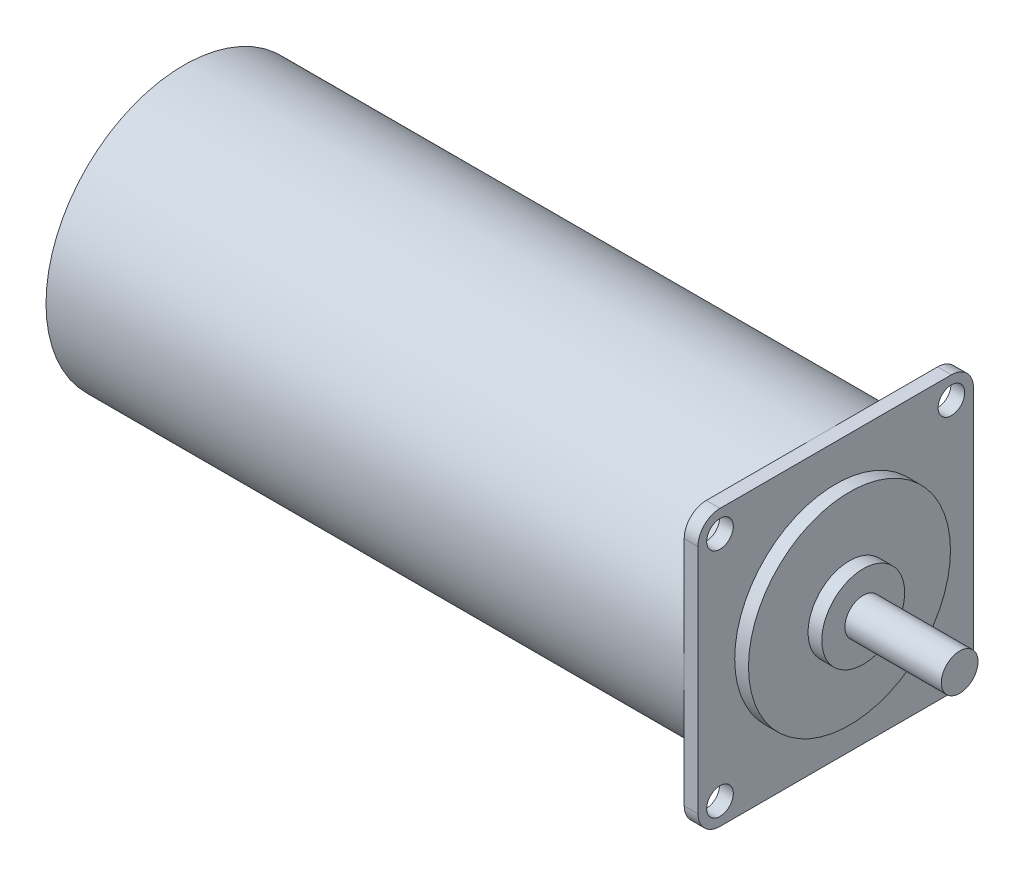
ISO-10303-21;
HEADER;
FILE_DESCRIPTION(('STEP AP214'),'2;1');
FILE_NAME('part.step','',(''),(''),'','','');
FILE_SCHEMA(('AUTOMOTIVE_DESIGN { 1 0 10303 214 1 1 1 1 }'));
ENDSEC;
DATA;
#1=APPLICATION_CONTEXT('core data for automotive mechanical design processes');
#2=APPLICATION_PROTOCOL_DEFINITION('international standard','automotive_design',2000,#1);
#3=PRODUCT_CONTEXT('',#1,'mechanical');
#4=PRODUCT('Part','Part','',(#3));
#5=PRODUCT_RELATED_PRODUCT_CATEGORY('part','',(#4));
#6=PRODUCT_DEFINITION_FORMATION('','',#4);
#7=PRODUCT_DEFINITION_CONTEXT('part definition',#1,'design');
#8=PRODUCT_DEFINITION('design','',#6,#7);
#9=PRODUCT_DEFINITION_SHAPE('','',#8);
#10=(LENGTH_UNIT() NAMED_UNIT(*) SI_UNIT(.MILLI.,.METRE.));
#11=(NAMED_UNIT(*) PLANE_ANGLE_UNIT() SI_UNIT($,.RADIAN.));
#12=(NAMED_UNIT(*) SI_UNIT($,.STERADIAN.) SOLID_ANGLE_UNIT());
#13=UNCERTAINTY_MEASURE_WITH_UNIT(LENGTH_MEASURE(1.E-05),#10,'distance_accuracy_value','');
#14=(GEOMETRIC_REPRESENTATION_CONTEXT(3) GLOBAL_UNCERTAINTY_ASSIGNED_CONTEXT((#13)) GLOBAL_UNIT_ASSIGNED_CONTEXT((#10,
#11,#12)) REPRESENTATION_CONTEXT('',''));
#15=CARTESIAN_POINT('',(0.,0.,0.));
#16=DIRECTION('',(0.,0.,1.));
#17=DIRECTION('',(1.,0.,0.));
#18=AXIS2_PLACEMENT_3D('',#15,#16,#17);
#19=CARTESIAN_POINT('',(71.,15.,0.));
#20=DIRECTION('',(-1.,0.,0.));
#21=DIRECTION('',(0.,0.,1.));
#22=AXIS2_PLACEMENT_3D('',#19,#20,#21);
#23=PLANE('',#22);
#24=DIRECTION('',(0.,0.,-1.));
#25=VECTOR('',#24,1.);
#26=CARTESIAN_POINT('',(71.,-15.,-15.));
#27=LINE('',#26,#25);
#28=CARTESIAN_POINT('',(71.,-15.,12.6));
#29=VERTEX_POINT('',#28);
#30=CARTESIAN_POINT('',(71.,-15.,-12.6));
#31=VERTEX_POINT('',#30);
#32=EDGE_CURVE('E227',#29,#31,#27,.T.);
#33=ORIENTED_EDGE('',*,*,#32,.T.);
#34=CARTESIAN_POINT('',(71.,-12.6,-12.6));
#35=DIRECTION('',(-1.,0.,0.));
#36=DIRECTION('',(0.,0.,1.));
#37=AXIS2_PLACEMENT_3D('',#34,#35,#36);
#38=CIRCLE('',#37,2.4);
#39=CARTESIAN_POINT('',(71.,-12.6,-15.));
#40=VERTEX_POINT('',#39);
#41=EDGE_CURVE('E182',#31,#40,#38,.F.);
#42=ORIENTED_EDGE('',*,*,#41,.T.);
#43=DIRECTION('',(0.,1.,0.));
#44=VECTOR('',#43,1.);
#45=CARTESIAN_POINT('',(71.,-15.,-15.));
#46=LINE('',#45,#44);
#47=CARTESIAN_POINT('',(71.,12.6,-15.));
#48=VERTEX_POINT('',#47);
#49=EDGE_CURVE('E222',#40,#48,#46,.T.);
#50=ORIENTED_EDGE('',*,*,#49,.T.);
#51=CARTESIAN_POINT('',(71.,12.6,-12.6));
#52=DIRECTION('',(-1.,0.,0.));
#53=DIRECTION('',(0.,0.,1.));
#54=AXIS2_PLACEMENT_3D('',#51,#52,#53);
#55=CIRCLE('',#54,2.4);
#56=CARTESIAN_POINT('',(71.,15.,-12.6));
#57=VERTEX_POINT('',#56);
#58=EDGE_CURVE('E173',#48,#57,#55,.F.);
#59=ORIENTED_EDGE('',*,*,#58,.T.);
#60=DIRECTION('',(0.,0.,1.));
#61=VECTOR('',#60,1.);
#62=CARTESIAN_POINT('',(71.,15.,-15.));
#63=LINE('',#62,#61);
#64=CARTESIAN_POINT('',(71.,15.,12.6));
#65=VERTEX_POINT('',#64);
#66=EDGE_CURVE('E212',#57,#65,#63,.T.);
#67=ORIENTED_EDGE('',*,*,#66,.T.);
#68=CARTESIAN_POINT('',(71.,12.6,12.6));
#69=DIRECTION('',(-1.,0.,0.));
#70=DIRECTION('',(0.,0.,1.));
#71=AXIS2_PLACEMENT_3D('',#68,#69,#70);
#72=CIRCLE('',#71,2.4);
#73=CARTESIAN_POINT('',(71.,12.6,15.));
#74=VERTEX_POINT('',#73);
#75=EDGE_CURVE('E176',#65,#74,#72,.F.);
#76=ORIENTED_EDGE('',*,*,#75,.T.);
#77=DIRECTION('',(0.,-1.,0.));
#78=VECTOR('',#77,1.);
#79=CARTESIAN_POINT('',(71.,-15.,15.));
#80=LINE('',#79,#78);
#81=CARTESIAN_POINT('',(71.,-12.6,15.));
#82=VERTEX_POINT('',#81);
#83=EDGE_CURVE('E221',#74,#82,#80,.T.);
#84=ORIENTED_EDGE('',*,*,#83,.T.);
#85=CARTESIAN_POINT('',(71.,-12.6,12.6));
#86=DIRECTION('',(-1.,0.,0.));
#87=DIRECTION('',(0.,0.,1.));
#88=AXIS2_PLACEMENT_3D('',#85,#86,#87);
#89=CIRCLE('',#88,2.4);
#90=EDGE_CURVE('E179',#82,#29,#89,.F.);
#91=ORIENTED_EDGE('',*,*,#90,.T.);
#92=EDGE_LOOP('',(#33,#42,#50,#59,#67,#76,#84,#91));
#93=FACE_BOUND('',#92,.T.);
#94=CARTESIAN_POINT('',(71.,0.,0.));
#95=DIRECTION('',(-1.,0.,0.));
#96=DIRECTION('',(0.,0.,1.));
#97=AXIS2_PLACEMENT_3D('',#94,#95,#96);
#98=CIRCLE('',#97,11.);
#99=CARTESIAN_POINT('',(71.,0.,11.));
#100=VERTEX_POINT('',#99);
#101=EDGE_CURVE('E251',#100,#100,#98,.T.);
#102=ORIENTED_EDGE('',*,*,#101,.T.);
#103=EDGE_LOOP('',(#102));
#104=FACE_BOUND('',#103,.T.);
#105=CARTESIAN_POINT('',(71.,-12.6,12.6));
#106=DIRECTION('',(1.,0.,0.));
#107=DIRECTION('',(0.,0.,1.));
#108=AXIS2_PLACEMENT_3D('',#105,#106,#107);
#109=CIRCLE('',#108,1.45);
#110=CARTESIAN_POINT('',(71.,-12.6,14.05));
#111=VERTEX_POINT('',#110);
#112=EDGE_CURVE('E340',#111,#111,#109,.T.);
#113=ORIENTED_EDGE('',*,*,#112,.F.);
#114=EDGE_LOOP('',(#113));
#115=FACE_BOUND('',#114,.T.);
#116=CARTESIAN_POINT('',(71.,-12.6,-12.6));
#117=DIRECTION('',(1.,0.,0.));
#118=DIRECTION('',(0.,0.,-1.));
#119=AXIS2_PLACEMENT_3D('',#116,#117,#118);
#120=CIRCLE('',#119,1.45);
#121=CARTESIAN_POINT('',(71.,-12.6,-14.05));
#122=VERTEX_POINT('',#121);
#123=EDGE_CURVE('E345',#122,#122,#120,.T.);
#124=ORIENTED_EDGE('',*,*,#123,.F.);
#125=EDGE_LOOP('',(#124));
#126=FACE_BOUND('',#125,.T.);
#127=CARTESIAN_POINT('',(71.,12.6,-12.6));
#128=DIRECTION('',(1.,0.,0.));
#129=DIRECTION('',(0.,0.,1.));
#130=AXIS2_PLACEMENT_3D('',#127,#128,#129);
#131=CIRCLE('',#130,1.45);
#132=CARTESIAN_POINT('',(71.,12.6,-11.15));
#133=VERTEX_POINT('',#132);
#134=EDGE_CURVE('E352',#133,#133,#131,.T.);
#135=ORIENTED_EDGE('',*,*,#134,.F.);
#136=EDGE_LOOP('',(#135));
#137=FACE_BOUND('',#136,.T.);
#138=CARTESIAN_POINT('',(71.,12.6,12.6));
#139=DIRECTION('',(1.,0.,0.));
#140=DIRECTION('',(0.,0.,-1.));
#141=AXIS2_PLACEMENT_3D('',#138,#139,#140);
#142=CIRCLE('',#141,1.45);
#143=CARTESIAN_POINT('',(71.,12.6,11.15));
#144=VERTEX_POINT('',#143);
#145=EDGE_CURVE('E360',#144,#144,#142,.T.);
#146=ORIENTED_EDGE('',*,*,#145,.F.);
#147=EDGE_LOOP('',(#146));
#148=FACE_BOUND('',#147,.T.);
#149=ADVANCED_FACE('F39',(#93,#104,#115,#126,#137,#148),#23,.F.);
#150=CARTESIAN_POINT('',(0.,0.,0.));
#151=DIRECTION('',(-1.,0.,0.));
#152=DIRECTION('',(0.,0.,1.));
#153=AXIS2_PLACEMENT_3D('',#150,#151,#152);
#154=CYLINDRICAL_SURFACE('',#153,11.);
#155=ORIENTED_EDGE('',*,*,#101,.F.);
#156=EDGE_LOOP('',(#155));
#157=FACE_BOUND('',#156,.T.);
#158=CARTESIAN_POINT('',(72.5,0.,0.));
#159=DIRECTION('',(-1.,0.,0.));
#160=DIRECTION('',(0.,0.,1.));
#161=AXIS2_PLACEMENT_3D('',#158,#159,#160);
#162=CIRCLE('',#161,11.);
#163=CARTESIAN_POINT('',(72.5,0.,11.));
#164=VERTEX_POINT('',#163);
#165=EDGE_CURVE('E248',#164,#164,#162,.T.);
#166=ORIENTED_EDGE('',*,*,#165,.T.);
#167=EDGE_LOOP('',(#166));
#168=FACE_BOUND('',#167,.T.);
#169=ADVANCED_FACE('F274',(#157,#168),#154,.T.);
#170=CARTESIAN_POINT('',(72.5,11.,0.));
#171=DIRECTION('',(-1.,0.,0.));
#172=DIRECTION('',(0.,0.,1.));
#173=AXIS2_PLACEMENT_3D('',#170,#171,#172);
#174=PLANE('',#173);
#175=ORIENTED_EDGE('',*,*,#165,.F.);
#176=EDGE_LOOP('',(#175));
#177=FACE_BOUND('',#176,.T.);
#178=CARTESIAN_POINT('',(72.5,0.,0.));
#179=DIRECTION('',(-1.,0.,0.));
#180=DIRECTION('',(0.,0.,1.));
#181=AXIS2_PLACEMENT_3D('',#178,#179,#180);
#182=CIRCLE('',#181,4.51182210726465);
#183=CARTESIAN_POINT('',(72.5,0.,4.51182210726465));
#184=VERTEX_POINT('',#183);
#185=EDGE_CURVE('E244',#184,#184,#182,.T.);
#186=ORIENTED_EDGE('',*,*,#185,.T.);
#187=EDGE_LOOP('',(#186));
#188=FACE_BOUND('',#187,.T.);
#189=ADVANCED_FACE('F278',(#177,#188),#174,.F.);
#190=CARTESIAN_POINT('',(0.,0.,0.));
#191=DIRECTION('',(-1.,0.,0.));
#192=DIRECTION('',(0.,0.,1.));
#193=AXIS2_PLACEMENT_3D('',#190,#191,#192);
#194=CYLINDRICAL_SURFACE('',#193,4.51182210726465);
#195=ORIENTED_EDGE('',*,*,#185,.F.);
#196=EDGE_LOOP('',(#195));
#197=FACE_BOUND('',#196,.T.);
#198=CARTESIAN_POINT('',(74.,0.,0.));
#199=DIRECTION('',(-1.,0.,0.));
#200=DIRECTION('',(0.,0.,1.));
#201=AXIS2_PLACEMENT_3D('',#198,#199,#200);
#202=CIRCLE('',#201,4.51182210726465);
#203=CARTESIAN_POINT('',(74.,0.,4.51182210726465));
#204=VERTEX_POINT('',#203);
#205=EDGE_CURVE('E240',#204,#204,#202,.T.);
#206=ORIENTED_EDGE('',*,*,#205,.T.);
#207=EDGE_LOOP('',(#206));
#208=FACE_BOUND('',#207,.T.);
#209=ADVANCED_FACE('F284',(#197,#208),#194,.T.);
#210=CARTESIAN_POINT('',(74.,4.51182210726465,0.));
#211=DIRECTION('',(-1.,0.,0.));
#212=DIRECTION('',(0.,0.,1.));
#213=AXIS2_PLACEMENT_3D('',#210,#211,#212);
#214=PLANE('',#213);
#215=ORIENTED_EDGE('',*,*,#205,.F.);
#216=EDGE_LOOP('',(#215));
#217=FACE_BOUND('',#216,.T.);
#218=CARTESIAN_POINT('',(74.,0.,0.));
#219=DIRECTION('',(-1.,0.,0.));
#220=DIRECTION('',(0.,0.,1.));
#221=AXIS2_PLACEMENT_3D('',#218,#219,#220);
#222=CIRCLE('',#221,2.);
#223=CARTESIAN_POINT('',(74.,0.,2.));
#224=VERTEX_POINT('',#223);
#225=EDGE_CURVE('E235',#224,#224,#222,.T.);
#226=ORIENTED_EDGE('',*,*,#225,.T.);
#227=EDGE_LOOP('',(#226));
#228=FACE_BOUND('',#227,.T.);
#229=ADVANCED_FACE('F288',(#217,#228),#214,.F.);
#230=CARTESIAN_POINT('',(0.,0.,0.));
#231=DIRECTION('',(-1.,0.,0.));
#232=DIRECTION('',(0.,0.,1.));
#233=AXIS2_PLACEMENT_3D('',#230,#231,#232);
#234=CYLINDRICAL_SURFACE('',#233,2.);
#235=ORIENTED_EDGE('',*,*,#225,.F.);
#236=EDGE_LOOP('',(#235));
#237=FACE_BOUND('',#236,.T.);
#238=CARTESIAN_POINT('',(84.5,0.,0.));
#239=DIRECTION('',(-1.,0.,0.));
#240=DIRECTION('',(0.,0.,1.));
#241=AXIS2_PLACEMENT_3D('',#238,#239,#240);
#242=CIRCLE('',#241,2.);
#243=CARTESIAN_POINT('',(84.5,0.,2.));
#244=VERTEX_POINT('',#243);
#245=EDGE_CURVE('E231',#244,#244,#242,.T.);
#246=ORIENTED_EDGE('',*,*,#245,.T.);
#247=EDGE_LOOP('',(#246));
#248=FACE_BOUND('',#247,.T.);
#249=ADVANCED_FACE('F292',(#237,#248),#234,.T.);
#250=CARTESIAN_POINT('',(84.5,2.,0.));
#251=DIRECTION('',(-1.,0.,0.));
#252=DIRECTION('',(0.,0.,1.));
#253=AXIS2_PLACEMENT_3D('',#250,#251,#252);
#254=PLANE('',#253);
#255=ORIENTED_EDGE('',*,*,#245,.F.);
#256=EDGE_LOOP('',(#255));
#257=FACE_BOUND('',#256,.T.);
#258=ADVANCED_FACE('F296',(#257),#254,.F.);
#259=CARTESIAN_POINT('',(69.5,0.,0.));
#260=DIRECTION('',(-1.,0.,0.));
#261=DIRECTION('',(0.,0.,1.));
#262=AXIS2_PLACEMENT_3D('',#259,#260,#261);
#263=PLANE('',#262);
#264=DIRECTION('',(0.,-1.,0.));
#265=VECTOR('',#264,1.);
#266=CARTESIAN_POINT('',(69.5,-15.,15.));
#267=LINE('',#266,#265);
#268=CARTESIAN_POINT('',(69.5,12.6,15.));
#269=VERTEX_POINT('',#268);
#270=CARTESIAN_POINT('',(69.5,0.,15.));
#271=VERTEX_POINT('',#270);
#272=EDGE_CURVE('E236',#269,#271,#267,.T.);
#273=ORIENTED_EDGE('',*,*,#272,.F.);
#274=CARTESIAN_POINT('',(69.5,12.6,12.6));
#275=DIRECTION('',(-1.,0.,0.));
#276=DIRECTION('',(0.,0.,1.));
#277=AXIS2_PLACEMENT_3D('',#274,#275,#276);
#278=CIRCLE('',#277,2.4);
#279=CARTESIAN_POINT('',(69.5,15.,12.6));
#280=VERTEX_POINT('',#279);
#281=EDGE_CURVE('E48',#269,#280,#278,.T.);
#282=ORIENTED_EDGE('',*,*,#281,.T.);
#283=DIRECTION('',(0.,0.,1.));
#284=VECTOR('',#283,1.);
#285=CARTESIAN_POINT('',(69.5,15.,-15.));
#286=LINE('',#285,#284);
#287=CARTESIAN_POINT('',(69.5,15.,0.));
#288=VERTEX_POINT('',#287);
#289=EDGE_CURVE('E131',#288,#280,#286,.T.);
#290=ORIENTED_EDGE('',*,*,#289,.F.);
#291=CARTESIAN_POINT('',(69.5,0.,0.));
#292=DIRECTION('',(-1.,0.,0.));
#293=DIRECTION('',(0.,0.,1.));
#294=AXIS2_PLACEMENT_3D('',#291,#292,#293);
#295=CIRCLE('',#294,15.);
#296=EDGE_CURVE('E158',#271,#288,#295,.T.);
#297=ORIENTED_EDGE('',*,*,#296,.F.);
#298=EDGE_LOOP('',(#273,#282,#290,#297));
#299=FACE_BOUND('',#298,.T.);
#300=CARTESIAN_POINT('',(69.5,12.6,12.6));
#301=DIRECTION('',(1.,0.,0.));
#302=DIRECTION('',(0.,0.,-1.));
#303=AXIS2_PLACEMENT_3D('',#300,#301,#302);
#304=CIRCLE('',#303,1.45);
#305=CARTESIAN_POINT('',(69.5,12.6,11.15));
#306=VERTEX_POINT('',#305);
#307=EDGE_CURVE('E364',#306,#306,#304,.T.);
#308=ORIENTED_EDGE('',*,*,#307,.T.);
#309=EDGE_LOOP('',(#308));
#310=FACE_BOUND('',#309,.T.);
#311=ADVANCED_FACE('F300',(#299,#310),#263,.T.);
#312=CARTESIAN_POINT('',(69.5,15.,-12.6));
#313=VERTEX_POINT('',#312);
#314=EDGE_CURVE('E373',#313,#288,#286,.T.);
#315=ORIENTED_EDGE('',*,*,#314,.F.);
#316=CARTESIAN_POINT('',(69.5,12.6,-12.6));
#317=DIRECTION('',(-1.,0.,0.));
#318=DIRECTION('',(0.,0.,1.));
#319=AXIS2_PLACEMENT_3D('',#316,#317,#318);
#320=CIRCLE('',#319,2.4);
#321=CARTESIAN_POINT('',(69.5,12.6,-15.));
#322=VERTEX_POINT('',#321);
#323=EDGE_CURVE('E11',#313,#322,#320,.T.);
#324=ORIENTED_EDGE('',*,*,#323,.T.);
#325=DIRECTION('',(0.,1.,0.));
#326=VECTOR('',#325,1.);
#327=CARTESIAN_POINT('',(69.5,-15.,-15.));
#328=LINE('',#327,#326);
#329=CARTESIAN_POINT('',(69.5,0.,-15.));
#330=VERTEX_POINT('',#329);
#331=EDGE_CURVE('E124',#330,#322,#328,.T.);
#332=ORIENTED_EDGE('',*,*,#331,.F.);
#333=EDGE_CURVE('E144',#288,#330,#295,.T.);
#334=ORIENTED_EDGE('',*,*,#333,.F.);
#335=EDGE_LOOP('',(#315,#324,#332,#334));
#336=FACE_BOUND('',#335,.T.);
#337=CARTESIAN_POINT('',(69.5,12.6,-12.6));
#338=DIRECTION('',(1.,0.,0.));
#339=DIRECTION('',(0.,0.,1.));
#340=AXIS2_PLACEMENT_3D('',#337,#338,#339);
#341=CIRCLE('',#340,1.45);
#342=CARTESIAN_POINT('',(69.5,12.6,-11.15));
#343=VERTEX_POINT('',#342);
#344=EDGE_CURVE('E356',#343,#343,#341,.T.);
#345=ORIENTED_EDGE('',*,*,#344,.T.);
#346=EDGE_LOOP('',(#345));
#347=FACE_BOUND('',#346,.T.);
#348=ADVANCED_FACE('F149',(#336,#347),#263,.T.);
#349=CARTESIAN_POINT('',(69.5,-12.6,-15.));
#350=VERTEX_POINT('',#349);
#351=EDGE_CURVE('E118',#350,#330,#328,.T.);
#352=ORIENTED_EDGE('',*,*,#351,.F.);
#353=CARTESIAN_POINT('',(69.5,-12.6,-12.6));
#354=DIRECTION('',(-1.,0.,0.));
#355=DIRECTION('',(0.,0.,1.));
#356=AXIS2_PLACEMENT_3D('',#353,#354,#355);
#357=CIRCLE('',#356,2.4);
#358=CARTESIAN_POINT('',(69.5,-15.,-12.6));
#359=VERTEX_POINT('',#358);
#360=EDGE_CURVE('E190',#350,#359,#357,.T.);
#361=ORIENTED_EDGE('',*,*,#360,.T.);
#362=DIRECTION('',(0.,0.,-1.));
#363=VECTOR('',#362,1.);
#364=CARTESIAN_POINT('',(69.5,-15.,-15.));
#365=LINE('',#364,#363);
#366=CARTESIAN_POINT('',(69.5,-15.,0.));
#367=VERTEX_POINT('',#366);
#368=EDGE_CURVE('E139',#367,#359,#365,.T.);
#369=ORIENTED_EDGE('',*,*,#368,.F.);
#370=EDGE_CURVE('E135',#330,#367,#295,.T.);
#371=ORIENTED_EDGE('',*,*,#370,.F.);
#372=EDGE_LOOP('',(#352,#361,#369,#371));
#373=FACE_BOUND('',#372,.T.);
#374=CARTESIAN_POINT('',(69.5,-12.6,-12.6));
#375=DIRECTION('',(1.,0.,0.));
#376=DIRECTION('',(0.,0.,-1.));
#377=AXIS2_PLACEMENT_3D('',#374,#375,#376);
#378=CIRCLE('',#377,1.45);
#379=CARTESIAN_POINT('',(69.5,-12.6,-14.05));
#380=VERTEX_POINT('',#379);
#381=EDGE_CURVE('E348',#380,#380,#378,.T.);
#382=ORIENTED_EDGE('',*,*,#381,.T.);
#383=EDGE_LOOP('',(#382));
#384=FACE_BOUND('',#383,.T.);
#385=ADVANCED_FACE('F136',(#373,#384),#263,.T.);
#386=CARTESIAN_POINT('',(69.5,-15.,-15.));
#387=DIRECTION('',(0.,-1.,0.));
#388=DIRECTION('',(0.,0.,-1.));
#389=AXIS2_PLACEMENT_3D('',#386,#387,#388);
#390=PLANE('',#389);
#391=ORIENTED_EDGE('',*,*,#368,.T.);
#392=DIRECTION('',(1.,0.,0.));
#393=VECTOR('',#392,1.);
#394=CARTESIAN_POINT('',(69.5,-15.,-12.6));
#395=LINE('',#394,#393);
#396=EDGE_CURVE('E169',#359,#31,#395,.T.);
#397=ORIENTED_EDGE('',*,*,#396,.T.);
#398=ORIENTED_EDGE('',*,*,#32,.F.);
#399=DIRECTION('',(1.,0.,0.));
#400=VECTOR('',#399,1.);
#401=CARTESIAN_POINT('',(69.5,-15.,12.6));
#402=LINE('',#401,#400);
#403=CARTESIAN_POINT('',(69.5,-15.,12.6));
#404=VERTEX_POINT('',#403);
#405=EDGE_CURVE('E161',#29,#404,#402,.F.);
#406=ORIENTED_EDGE('',*,*,#405,.T.);
#407=EDGE_CURVE('E153',#404,#367,#365,.T.);
#408=ORIENTED_EDGE('',*,*,#407,.T.);
#409=EDGE_LOOP('',(#391,#397,#398,#406,#408));
#410=FACE_BOUND('',#409,.T.);
#411=ADVANCED_FACE('F302',(#410),#390,.T.);
#412=CARTESIAN_POINT('',(69.5,-15.,15.));
#413=DIRECTION('',(0.,0.,1.));
#414=DIRECTION('',(1.,0.,0.));
#415=AXIS2_PLACEMENT_3D('',#412,#413,#414);
#416=PLANE('',#415);
#417=CARTESIAN_POINT('',(69.5,-12.6,15.));
#418=VERTEX_POINT('',#417);
#419=EDGE_CURVE('E376',#271,#418,#267,.T.);
#420=ORIENTED_EDGE('',*,*,#419,.T.);
#421=DIRECTION('',(1.,0.,0.));
#422=VECTOR('',#421,1.);
#423=CARTESIAN_POINT('',(69.5,-12.6,15.));
#424=LINE('',#423,#422);
#425=EDGE_CURVE('E196',#418,#82,#424,.T.);
#426=ORIENTED_EDGE('',*,*,#425,.T.);
#427=ORIENTED_EDGE('',*,*,#83,.F.);
#428=DIRECTION('',(1.,0.,0.));
#429=VECTOR('',#428,1.);
#430=CARTESIAN_POINT('',(69.5,12.6,15.));
#431=LINE('',#430,#429);
#432=EDGE_CURVE('E193',#74,#269,#431,.F.);
#433=ORIENTED_EDGE('',*,*,#432,.T.);
#434=ORIENTED_EDGE('',*,*,#272,.T.);
#435=EDGE_LOOP('',(#420,#426,#427,#433,#434));
#436=FACE_BOUND('',#435,.T.);
#437=ADVANCED_FACE('F305',(#436),#416,.T.);
#438=CARTESIAN_POINT('',(69.5,15.,-15.));
#439=DIRECTION('',(0.,1.,0.));
#440=DIRECTION('',(0.,0.,1.));
#441=AXIS2_PLACEMENT_3D('',#438,#439,#440);
#442=PLANE('',#441);
#443=ORIENTED_EDGE('',*,*,#289,.T.);
#444=DIRECTION('',(1.,0.,0.));
#445=VECTOR('',#444,1.);
#446=CARTESIAN_POINT('',(69.5,15.,12.6));
#447=LINE('',#446,#445);
#448=EDGE_CURVE('E205',#280,#65,#447,.T.);
#449=ORIENTED_EDGE('',*,*,#448,.T.);
#450=ORIENTED_EDGE('',*,*,#66,.F.);
#451=DIRECTION('',(1.,0.,0.));
#452=VECTOR('',#451,1.);
#453=CARTESIAN_POINT('',(69.5,15.,-12.6));
#454=LINE('',#453,#452);
#455=EDGE_CURVE('E62',#57,#313,#454,.F.);
#456=ORIENTED_EDGE('',*,*,#455,.T.);
#457=ORIENTED_EDGE('',*,*,#314,.T.);
#458=EDGE_LOOP('',(#443,#449,#450,#456,#457));
#459=FACE_BOUND('',#458,.T.);
#460=ADVANCED_FACE('F211',(#459),#442,.T.);
#461=CARTESIAN_POINT('',(69.5,-15.,-15.));
#462=DIRECTION('',(0.,0.,-1.));
#463=DIRECTION('',(-1.,0.,0.));
#464=AXIS2_PLACEMENT_3D('',#461,#462,#463);
#465=PLANE('',#464);
#466=ORIENTED_EDGE('',*,*,#49,.F.);
#467=DIRECTION('',(1.,0.,0.));
#468=VECTOR('',#467,1.);
#469=CARTESIAN_POINT('',(69.5,-12.6,-15.));
#470=LINE('',#469,#468);
#471=EDGE_CURVE('E127',#40,#350,#470,.F.);
#472=ORIENTED_EDGE('',*,*,#471,.T.);
#473=ORIENTED_EDGE('',*,*,#351,.T.);
#474=ORIENTED_EDGE('',*,*,#331,.T.);
#475=DIRECTION('',(1.,0.,0.));
#476=VECTOR('',#475,1.);
#477=CARTESIAN_POINT('',(69.5,12.6,-15.));
#478=LINE('',#477,#476);
#479=EDGE_CURVE('E185',#322,#48,#478,.T.);
#480=ORIENTED_EDGE('',*,*,#479,.T.);
#481=EDGE_LOOP('',(#466,#472,#473,#474,#480));
#482=FACE_BOUND('',#481,.T.);
#483=ADVANCED_FACE('F121',(#482),#465,.T.);
#484=ORIENTED_EDGE('',*,*,#407,.F.);
#485=CARTESIAN_POINT('',(69.5,-12.6,12.6));
#486=DIRECTION('',(-1.,0.,0.));
#487=DIRECTION('',(0.,0.,1.));
#488=AXIS2_PLACEMENT_3D('',#485,#486,#487);
#489=CIRCLE('',#488,2.4);
#490=EDGE_CURVE('E200',#404,#418,#489,.T.);
#491=ORIENTED_EDGE('',*,*,#490,.T.);
#492=ORIENTED_EDGE('',*,*,#419,.F.);
#493=EDGE_CURVE('E145',#367,#271,#295,.T.);
#494=ORIENTED_EDGE('',*,*,#493,.F.);
#495=EDGE_LOOP('',(#484,#491,#492,#494));
#496=FACE_BOUND('',#495,.T.);
#497=CARTESIAN_POINT('',(69.5,-12.6,12.6));
#498=DIRECTION('',(1.,0.,0.));
#499=DIRECTION('',(0.,0.,1.));
#500=AXIS2_PLACEMENT_3D('',#497,#498,#499);
#501=CIRCLE('',#500,1.45);
#502=CARTESIAN_POINT('',(69.5,-12.6,14.05));
#503=VERTEX_POINT('',#502);
#504=EDGE_CURVE('E337',#503,#503,#501,.T.);
#505=ORIENTED_EDGE('',*,*,#504,.T.);
#506=EDGE_LOOP('',(#505));
#507=FACE_BOUND('',#506,.T.);
#508=ADVANCED_FACE('F309',(#496,#507),#263,.T.);
#509=CARTESIAN_POINT('',(69.5,12.6,12.6));
#510=DIRECTION('',(1.,0.,0.));
#511=DIRECTION('',(0.,0.,-1.));
#512=AXIS2_PLACEMENT_3D('',#509,#510,#511);
#513=CYLINDRICAL_SURFACE('',#512,1.45);
#514=ORIENTED_EDGE('',*,*,#307,.F.);
#515=EDGE_LOOP('',(#514));
#516=FACE_BOUND('',#515,.T.);
#517=ORIENTED_EDGE('',*,*,#145,.T.);
#518=EDGE_LOOP('',(#517));
#519=FACE_BOUND('',#518,.T.);
#520=ADVANCED_FACE('F317',(#516,#519),#513,.F.);
#521=CARTESIAN_POINT('',(69.5,12.6,-12.6));
#522=DIRECTION('',(1.,0.,0.));
#523=DIRECTION('',(0.,0.,-1.));
#524=AXIS2_PLACEMENT_3D('',#521,#522,#523);
#525=CYLINDRICAL_SURFACE('',#524,1.45);
#526=ORIENTED_EDGE('',*,*,#344,.F.);
#527=EDGE_LOOP('',(#526));
#528=FACE_BOUND('',#527,.T.);
#529=ORIENTED_EDGE('',*,*,#134,.T.);
#530=EDGE_LOOP('',(#529));
#531=FACE_BOUND('',#530,.T.);
#532=ADVANCED_FACE('F321',(#528,#531),#525,.F.);
#533=CARTESIAN_POINT('',(69.5,-12.6,-12.6));
#534=DIRECTION('',(1.,0.,0.));
#535=DIRECTION('',(0.,0.,-1.));
#536=AXIS2_PLACEMENT_3D('',#533,#534,#535);
#537=CYLINDRICAL_SURFACE('',#536,1.45);
#538=ORIENTED_EDGE('',*,*,#381,.F.);
#539=EDGE_LOOP('',(#538));
#540=FACE_BOUND('',#539,.T.);
#541=ORIENTED_EDGE('',*,*,#123,.T.);
#542=EDGE_LOOP('',(#541));
#543=FACE_BOUND('',#542,.T.);
#544=ADVANCED_FACE('F325',(#540,#543),#537,.F.);
#545=CARTESIAN_POINT('',(69.5,-12.6,12.6));
#546=DIRECTION('',(1.,0.,0.));
#547=DIRECTION('',(0.,0.,-1.));
#548=AXIS2_PLACEMENT_3D('',#545,#546,#547);
#549=CYLINDRICAL_SURFACE('',#548,1.45);
#550=ORIENTED_EDGE('',*,*,#504,.F.);
#551=EDGE_LOOP('',(#550));
#552=FACE_BOUND('',#551,.T.);
#553=ORIENTED_EDGE('',*,*,#112,.T.);
#554=EDGE_LOOP('',(#553));
#555=FACE_BOUND('',#554,.T.);
#556=ADVANCED_FACE('F270',(#552,#555),#549,.F.);
#557=CARTESIAN_POINT('',(0.,0.,0.));
#558=DIRECTION('',(1.,0.,0.));
#559=DIRECTION('',(0.,0.,-1.));
#560=AXIS2_PLACEMENT_3D('',#557,#558,#559);
#561=PLANE('',#560);
#562=CARTESIAN_POINT('',(0.,0.,0.));
#563=DIRECTION('',(-1.,0.,0.));
#564=DIRECTION('',(0.,0.,1.));
#565=AXIS2_PLACEMENT_3D('',#562,#563,#564);
#566=CIRCLE('',#565,15.);
#567=CARTESIAN_POINT('',(0.,0.,15.));
#568=VERTEX_POINT('',#567);
#569=EDGE_CURVE('E165',#568,#568,#566,.T.);
#570=ORIENTED_EDGE('',*,*,#569,.T.);
#571=EDGE_LOOP('',(#570));
#572=FACE_BOUND('',#571,.T.);
#573=ADVANCED_FACE('F259',(#572),#561,.F.);
#574=CARTESIAN_POINT('',(0.,0.,0.));
#575=DIRECTION('',(-1.,0.,0.));
#576=DIRECTION('',(0.,0.,1.));
#577=AXIS2_PLACEMENT_3D('',#574,#575,#576);
#578=CYLINDRICAL_SURFACE('',#577,15.);
#579=ORIENTED_EDGE('',*,*,#493,.T.);
#580=ORIENTED_EDGE('',*,*,#296,.T.);
#581=ORIENTED_EDGE('',*,*,#333,.T.);
#582=ORIENTED_EDGE('',*,*,#370,.T.);
#583=EDGE_LOOP('',(#579,#580,#581,#582));
#584=FACE_BOUND('',#583,.T.);
#585=ORIENTED_EDGE('',*,*,#569,.F.);
#586=EDGE_LOOP('',(#585));
#587=FACE_BOUND('',#586,.T.);
#588=ADVANCED_FACE('F155',(#584,#587),#578,.T.);
#589=CARTESIAN_POINT('',(69.5,-12.6,-12.6));
#590=DIRECTION('',(1.,0.,0.));
#591=DIRECTION('',(0.,0.,-1.));
#592=AXIS2_PLACEMENT_3D('',#589,#590,#591);
#593=CYLINDRICAL_SURFACE('',#592,2.4);
#594=ORIENTED_EDGE('',*,*,#360,.F.);
#595=ORIENTED_EDGE('',*,*,#471,.F.);
#596=ORIENTED_EDGE('',*,*,#41,.F.);
#597=ORIENTED_EDGE('',*,*,#396,.F.);
#598=EDGE_LOOP('',(#594,#595,#596,#597));
#599=FACE_BOUND('',#598,.T.);
#600=ADVANCED_FACE('F261',(#599),#593,.T.);
#601=CARTESIAN_POINT('',(69.5,-12.6,12.6));
#602=DIRECTION('',(1.,0.,0.));
#603=DIRECTION('',(0.,0.,-1.));
#604=AXIS2_PLACEMENT_3D('',#601,#602,#603);
#605=CYLINDRICAL_SURFACE('',#604,2.4);
#606=ORIENTED_EDGE('',*,*,#490,.F.);
#607=ORIENTED_EDGE('',*,*,#405,.F.);
#608=ORIENTED_EDGE('',*,*,#90,.F.);
#609=ORIENTED_EDGE('',*,*,#425,.F.);
#610=EDGE_LOOP('',(#606,#607,#608,#609));
#611=FACE_BOUND('',#610,.T.);
#612=ADVANCED_FACE('F267',(#611),#605,.T.);
#613=CARTESIAN_POINT('',(69.5,12.6,12.6));
#614=DIRECTION('',(1.,0.,0.));
#615=DIRECTION('',(0.,0.,-1.));
#616=AXIS2_PLACEMENT_3D('',#613,#614,#615);
#617=CYLINDRICAL_SURFACE('',#616,2.4);
#618=ORIENTED_EDGE('',*,*,#281,.F.);
#619=ORIENTED_EDGE('',*,*,#432,.F.);
#620=ORIENTED_EDGE('',*,*,#75,.F.);
#621=ORIENTED_EDGE('',*,*,#448,.F.);
#622=EDGE_LOOP('',(#618,#619,#620,#621));
#623=FACE_BOUND('',#622,.T.);
#624=ADVANCED_FACE('F395',(#623),#617,.T.);
#625=CARTESIAN_POINT('',(69.5,12.6,-12.6));
#626=DIRECTION('',(1.,0.,0.));
#627=DIRECTION('',(0.,0.,-1.));
#628=AXIS2_PLACEMENT_3D('',#625,#626,#627);
#629=CYLINDRICAL_SURFACE('',#628,2.4);
#630=ORIENTED_EDGE('',*,*,#323,.F.);
#631=ORIENTED_EDGE('',*,*,#455,.F.);
#632=ORIENTED_EDGE('',*,*,#58,.F.);
#633=ORIENTED_EDGE('',*,*,#479,.F.);
#634=EDGE_LOOP('',(#630,#631,#632,#633));
#635=FACE_BOUND('',#634,.T.);
#636=ADVANCED_FACE('F41',(#635),#629,.T.);
#637=CLOSED_SHELL('',(#149,#169,#189,#209,#229,#249,#258,#311,#348,#385,#411,#437,#460,#483,
#508,#520,#532,#544,#556,#573,#588,#600,#612,#624,#636));
#638=MANIFOLD_SOLID_BREP('B2',#637);
#639=ADVANCED_BREP_SHAPE_REPRESENTATION('',(#18,#638),#14);
#640=SHAPE_DEFINITION_REPRESENTATION(#9,#639);
ENDSEC;
END-ISO-10303-21;
